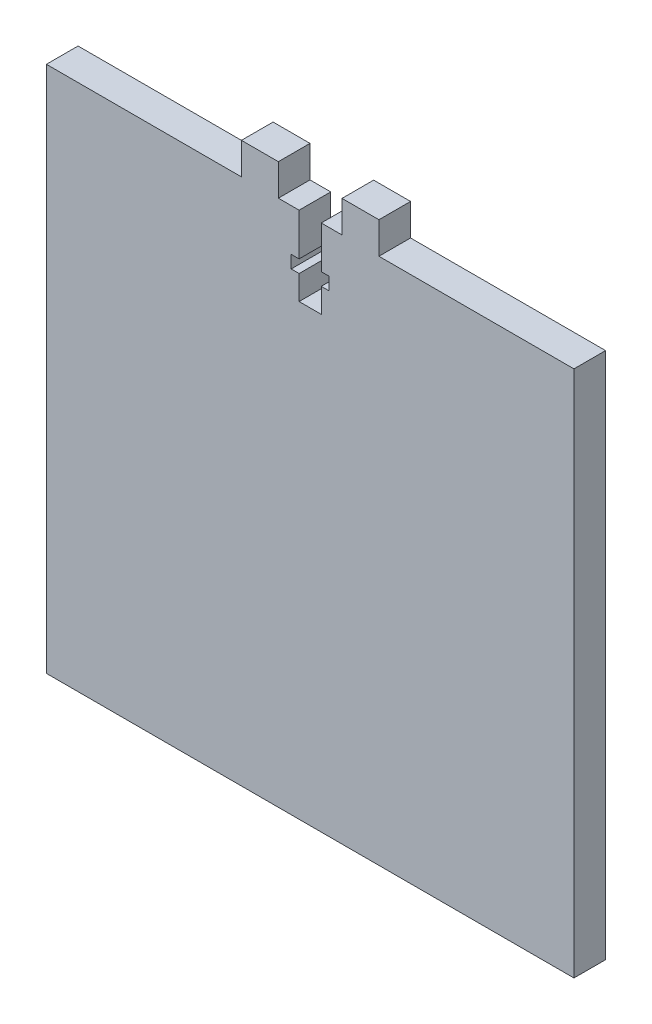
ISO-10303-21;
HEADER;
FILE_DESCRIPTION(('STEP AP214'),'2;1');
FILE_NAME('part.step','',(''),(''),'','','');
FILE_SCHEMA(('AUTOMOTIVE_DESIGN { 1 0 10303 214 1 1 1 1 }'));
ENDSEC;
DATA;
#1=APPLICATION_CONTEXT('core data for automotive mechanical design processes');
#2=APPLICATION_PROTOCOL_DEFINITION('international standard','automotive_design',2000,#1);
#3=PRODUCT_CONTEXT('',#1,'mechanical');
#4=PRODUCT('Part','Part','',(#3));
#5=PRODUCT_RELATED_PRODUCT_CATEGORY('part','',(#4));
#6=PRODUCT_DEFINITION_FORMATION('','',#4);
#7=PRODUCT_DEFINITION_CONTEXT('part definition',#1,'design');
#8=PRODUCT_DEFINITION('design','',#6,#7);
#9=PRODUCT_DEFINITION_SHAPE('','',#8);
#10=(LENGTH_UNIT() NAMED_UNIT(*) SI_UNIT(.MILLI.,.METRE.));
#11=(NAMED_UNIT(*) PLANE_ANGLE_UNIT() SI_UNIT($,.RADIAN.));
#12=(NAMED_UNIT(*) SI_UNIT($,.STERADIAN.) SOLID_ANGLE_UNIT());
#13=UNCERTAINTY_MEASURE_WITH_UNIT(LENGTH_MEASURE(1.E-05),#10,'distance_accuracy_value','');
#14=(GEOMETRIC_REPRESENTATION_CONTEXT(3) GLOBAL_UNCERTAINTY_ASSIGNED_CONTEXT((#13)) GLOBAL_UNIT_ASSIGNED_CONTEXT((#10,
#11,#12)) REPRESENTATION_CONTEXT('',''));
#15=CARTESIAN_POINT('',(0.,0.,0.));
#16=DIRECTION('',(0.,0.,1.));
#17=DIRECTION('',(1.,0.,0.));
#18=AXIS2_PLACEMENT_3D('',#15,#16,#17);
#19=CARTESIAN_POINT('',(-50.,50.,6.));
#20=DIRECTION('',(0.,-1.,0.));
#21=DIRECTION('',(0.,0.,-1.));
#22=AXIS2_PLACEMENT_3D('',#19,#20,#21);
#23=PLANE('',#22);
#24=DIRECTION('',(-1.,0.,0.));
#25=VECTOR('',#24,1.);
#26=CARTESIAN_POINT('',(-50.,50.,6.));
#27=LINE('',#26,#25);
#28=CARTESIAN_POINT('',(-2.10000000000001,50.,6.));
#29=VERTEX_POINT('',#28);
#30=CARTESIAN_POINT('',(-6.03184990821574,50.,6.));
#31=VERTEX_POINT('',#30);
#32=EDGE_CURVE('E358',#29,#31,#27,.T.);
#33=ORIENTED_EDGE('',*,*,#32,.F.);
#34=DIRECTION('',(0.,0.,1.));
#35=VECTOR('',#34,1.);
#36=CARTESIAN_POINT('',(-2.10000000000001,50.,0.));
#37=LINE('',#36,#35);
#38=CARTESIAN_POINT('',(-2.10000000000001,50.,0.));
#39=VERTEX_POINT('',#38);
#40=EDGE_CURVE('E275',#39,#29,#37,.T.);
#41=ORIENTED_EDGE('',*,*,#40,.F.);
#42=DIRECTION('',(-1.,0.,0.));
#43=VECTOR('',#42,1.);
#44=CARTESIAN_POINT('',(-50.,50.,0.));
#45=LINE('',#44,#43);
#46=CARTESIAN_POINT('',(-6.03184990821574,50.,0.));
#47=VERTEX_POINT('',#46);
#48=EDGE_CURVE('E219',#39,#47,#45,.T.);
#49=ORIENTED_EDGE('',*,*,#48,.T.);
#50=DIRECTION('',(0.,0.,1.));
#51=VECTOR('',#50,1.);
#52=CARTESIAN_POINT('',(-6.03184990821574,50.,0.));
#53=LINE('',#52,#51);
#54=EDGE_CURVE('E345',#47,#31,#53,.T.);
#55=ORIENTED_EDGE('',*,*,#54,.T.);
#56=EDGE_LOOP('',(#33,#41,#49,#55));
#57=FACE_BOUND('',#56,.T.);
#58=ADVANCED_FACE('F35',(#57),#23,.F.);
#59=CARTESIAN_POINT('',(50.,50.,0.));
#60=VERTEX_POINT('',#59);
#61=CARTESIAN_POINT('',(13.0318499082157,50.,0.));
#62=VERTEX_POINT('',#61);
#63=EDGE_CURVE('E366',#60,#62,#45,.T.);
#64=ORIENTED_EDGE('',*,*,#63,.T.);
#65=DIRECTION('',(0.,0.,1.));
#66=VECTOR('',#65,1.);
#67=CARTESIAN_POINT('',(13.0318499082157,50.,0.));
#68=LINE('',#67,#66);
#69=CARTESIAN_POINT('',(13.0318499082157,50.,6.));
#70=VERTEX_POINT('',#69);
#71=EDGE_CURVE('E315',#62,#70,#68,.T.);
#72=ORIENTED_EDGE('',*,*,#71,.T.);
#73=CARTESIAN_POINT('',(50.,50.,6.));
#74=VERTEX_POINT('',#73);
#75=EDGE_CURVE('E354',#74,#70,#27,.T.);
#76=ORIENTED_EDGE('',*,*,#75,.F.);
#77=DIRECTION('',(0.,0.,-1.));
#78=VECTOR('',#77,1.);
#79=CARTESIAN_POINT('',(50.,50.,6.));
#80=LINE('',#79,#78);
#81=EDGE_CURVE('E11',#74,#60,#80,.T.);
#82=ORIENTED_EDGE('',*,*,#81,.T.);
#83=EDGE_LOOP('',(#64,#72,#76,#82));
#84=FACE_BOUND('',#83,.T.);
#85=ADVANCED_FACE('F465',(#84),#23,.F.);
#86=DIRECTION('',(0.,0.,1.));
#87=VECTOR('',#86,1.);
#88=CARTESIAN_POINT('',(-13.0318499082157,50.,0.));
#89=LINE('',#88,#87);
#90=CARTESIAN_POINT('',(-13.0318499082157,50.,0.));
#91=VERTEX_POINT('',#90);
#92=CARTESIAN_POINT('',(-13.0318499082157,50.,6.));
#93=VERTEX_POINT('',#92);
#94=EDGE_CURVE('E332',#91,#93,#89,.T.);
#95=ORIENTED_EDGE('',*,*,#94,.F.);
#96=CARTESIAN_POINT('',(-50.,50.,0.));
#97=VERTEX_POINT('',#96);
#98=EDGE_CURVE('E365',#91,#97,#45,.T.);
#99=ORIENTED_EDGE('',*,*,#98,.T.);
#100=DIRECTION('',(0.,0.,-1.));
#101=VECTOR('',#100,1.);
#102=CARTESIAN_POINT('',(-50.,50.,6.));
#103=LINE('',#102,#101);
#104=CARTESIAN_POINT('',(-50.,50.,6.));
#105=VERTEX_POINT('',#104);
#106=EDGE_CURVE('E43',#105,#97,#103,.T.);
#107=ORIENTED_EDGE('',*,*,#106,.F.);
#108=EDGE_CURVE('E352',#93,#105,#27,.T.);
#109=ORIENTED_EDGE('',*,*,#108,.F.);
#110=EDGE_LOOP('',(#95,#99,#107,#109));
#111=FACE_BOUND('',#110,.T.);
#112=ADVANCED_FACE('F410',(#111),#23,.F.);
#113=CARTESIAN_POINT('',(50.,-50.,6.));
#114=DIRECTION('',(-1.,0.,0.));
#115=DIRECTION('',(0.,0.,1.));
#116=AXIS2_PLACEMENT_3D('',#113,#114,#115);
#117=PLANE('',#116);
#118=DIRECTION('',(0.,1.,0.));
#119=VECTOR('',#118,1.);
#120=CARTESIAN_POINT('',(50.,-50.,0.));
#121=LINE('',#120,#119);
#122=CARTESIAN_POINT('',(50.,-50.,0.));
#123=VERTEX_POINT('',#122);
#124=EDGE_CURVE('E342',#123,#60,#121,.T.);
#125=ORIENTED_EDGE('',*,*,#124,.T.);
#126=ORIENTED_EDGE('',*,*,#81,.F.);
#127=DIRECTION('',(0.,1.,0.));
#128=VECTOR('',#127,1.);
#129=CARTESIAN_POINT('',(50.,-50.,6.));
#130=LINE('',#129,#128);
#131=CARTESIAN_POINT('',(50.,-50.,6.));
#132=VERTEX_POINT('',#131);
#133=EDGE_CURVE('E349',#132,#74,#130,.T.);
#134=ORIENTED_EDGE('',*,*,#133,.F.);
#135=DIRECTION('',(0.,0.,-1.));
#136=VECTOR('',#135,1.);
#137=CARTESIAN_POINT('',(50.,-50.,6.));
#138=LINE('',#137,#136);
#139=EDGE_CURVE('E362',#132,#123,#138,.T.);
#140=ORIENTED_EDGE('',*,*,#139,.T.);
#141=EDGE_LOOP('',(#125,#126,#134,#140));
#142=FACE_BOUND('',#141,.T.);
#143=ADVANCED_FACE('F37',(#142),#117,.F.);
#144=CARTESIAN_POINT('',(6.03184990821572,50.,0.));
#145=VERTEX_POINT('',#144);
#146=CARTESIAN_POINT('',(2.09999999999999,50.,0.));
#147=VERTEX_POINT('',#146);
#148=EDGE_CURVE('E369',#145,#147,#45,.T.);
#149=ORIENTED_EDGE('',*,*,#148,.T.);
#150=DIRECTION('',(0.,0.,1.));
#151=VECTOR('',#150,1.);
#152=CARTESIAN_POINT('',(2.09999999999999,50.,0.));
#153=LINE('',#152,#151);
#154=CARTESIAN_POINT('',(2.09999999999999,50.,6.));
#155=VERTEX_POINT('',#154);
#156=EDGE_CURVE('E278',#147,#155,#153,.T.);
#157=ORIENTED_EDGE('',*,*,#156,.T.);
#158=CARTESIAN_POINT('',(6.03184990821572,50.,6.));
#159=VERTEX_POINT('',#158);
#160=EDGE_CURVE('E58',#159,#155,#27,.T.);
#161=ORIENTED_EDGE('',*,*,#160,.F.);
#162=DIRECTION('',(0.,0.,1.));
#163=VECTOR('',#162,1.);
#164=CARTESIAN_POINT('',(6.03184990821572,50.,0.));
#165=LINE('',#164,#163);
#166=EDGE_CURVE('E318',#145,#159,#165,.T.);
#167=ORIENTED_EDGE('',*,*,#166,.F.);
#168=EDGE_LOOP('',(#149,#157,#161,#167));
#169=FACE_BOUND('',#168,.T.);
#170=ADVANCED_FACE('F409',(#169),#23,.F.);
#171=CARTESIAN_POINT('',(-50.,-50.,6.));
#172=DIRECTION('',(1.,0.,0.));
#173=DIRECTION('',(0.,0.,-1.));
#174=AXIS2_PLACEMENT_3D('',#171,#172,#173);
#175=PLANE('',#174);
#176=DIRECTION('',(0.,-1.,0.));
#177=VECTOR('',#176,1.);
#178=CARTESIAN_POINT('',(-50.,-50.,0.));
#179=LINE('',#178,#177);
#180=CARTESIAN_POINT('',(-50.,-50.,0.));
#181=VERTEX_POINT('',#180);
#182=EDGE_CURVE('E368',#97,#181,#179,.T.);
#183=ORIENTED_EDGE('',*,*,#182,.T.);
#184=DIRECTION('',(0.,0.,-1.));
#185=VECTOR('',#184,1.);
#186=CARTESIAN_POINT('',(-50.,-50.,6.));
#187=LINE('',#186,#185);
#188=CARTESIAN_POINT('',(-50.,-50.,6.));
#189=VERTEX_POINT('',#188);
#190=EDGE_CURVE('E374',#189,#181,#187,.T.);
#191=ORIENTED_EDGE('',*,*,#190,.F.);
#192=DIRECTION('',(0.,-1.,0.));
#193=VECTOR('',#192,1.);
#194=CARTESIAN_POINT('',(-50.,-50.,6.));
#195=LINE('',#194,#193);
#196=EDGE_CURVE('E357',#105,#189,#195,.T.);
#197=ORIENTED_EDGE('',*,*,#196,.F.);
#198=ORIENTED_EDGE('',*,*,#106,.T.);
#199=EDGE_LOOP('',(#183,#191,#197,#198));
#200=FACE_BOUND('',#199,.T.);
#201=ADVANCED_FACE('F381',(#200),#175,.F.);
#202=CARTESIAN_POINT('',(-50.,-50.,6.));
#203=DIRECTION('',(0.,1.,0.));
#204=DIRECTION('',(0.,0.,1.));
#205=AXIS2_PLACEMENT_3D('',#202,#203,#204);
#206=PLANE('',#205);
#207=DIRECTION('',(1.,0.,0.));
#208=VECTOR('',#207,1.);
#209=CARTESIAN_POINT('',(-50.,-50.,0.));
#210=LINE('',#209,#208);
#211=EDGE_CURVE('E353',#181,#123,#210,.T.);
#212=ORIENTED_EDGE('',*,*,#211,.T.);
#213=ORIENTED_EDGE('',*,*,#139,.F.);
#214=DIRECTION('',(1.,0.,0.));
#215=VECTOR('',#214,1.);
#216=CARTESIAN_POINT('',(-50.,-50.,6.));
#217=LINE('',#216,#215);
#218=EDGE_CURVE('E360',#189,#132,#217,.T.);
#219=ORIENTED_EDGE('',*,*,#218,.F.);
#220=ORIENTED_EDGE('',*,*,#190,.T.);
#221=EDGE_LOOP('',(#212,#213,#219,#220));
#222=FACE_BOUND('',#221,.T.);
#223=ADVANCED_FACE('F391',(#222),#206,.F.);
#224=CARTESIAN_POINT('',(0.,0.,6.));
#225=DIRECTION('',(0.,0.,-1.));
#226=DIRECTION('',(-1.,0.,0.));
#227=AXIS2_PLACEMENT_3D('',#224,#225,#226);
#228=PLANE('',#227);
#229=DIRECTION('',(-1.,0.,0.));
#230=VECTOR('',#229,1.);
#231=CARTESIAN_POINT('',(-2.10000000000001,42.,6.));
#232=LINE('',#231,#230);
#233=CARTESIAN_POINT('',(-2.10000000000001,42.,6.));
#234=VERTEX_POINT('',#233);
#235=CARTESIAN_POINT('',(-3.60000000000001,42.,6.));
#236=VERTEX_POINT('',#235);
#237=EDGE_CURVE('E250',#234,#236,#232,.T.);
#238=ORIENTED_EDGE('',*,*,#237,.F.);
#239=DIRECTION('',(0.,-1.,0.));
#240=VECTOR('',#239,1.);
#241=CARTESIAN_POINT('',(-2.10000000000001,42.,6.));
#242=LINE('',#241,#240);
#243=EDGE_CURVE('E204',#29,#234,#242,.T.);
#244=ORIENTED_EDGE('',*,*,#243,.F.);
#245=ORIENTED_EDGE('',*,*,#32,.T.);
#246=DIRECTION('',(0.,1.,0.));
#247=VECTOR('',#246,1.);
#248=CARTESIAN_POINT('',(-6.03184990821574,50.,6.));
#249=LINE('',#248,#247);
#250=CARTESIAN_POINT('',(-6.03184990821574,56.,6.));
#251=VERTEX_POINT('',#250);
#252=EDGE_CURVE('E335',#31,#251,#249,.T.);
#253=ORIENTED_EDGE('',*,*,#252,.T.);
#254=DIRECTION('',(-1.,0.,0.));
#255=VECTOR('',#254,1.);
#256=CARTESIAN_POINT('',(-13.0318499082157,56.,6.));
#257=LINE('',#256,#255);
#258=CARTESIAN_POINT('',(-13.0318499082157,56.,6.));
#259=VERTEX_POINT('',#258);
#260=EDGE_CURVE('E326',#251,#259,#257,.T.);
#261=ORIENTED_EDGE('',*,*,#260,.T.);
#262=DIRECTION('',(0.,-1.,0.));
#263=VECTOR('',#262,1.);
#264=CARTESIAN_POINT('',(-13.0318499082157,50.,6.));
#265=LINE('',#264,#263);
#266=EDGE_CURVE('E317',#259,#93,#265,.T.);
#267=ORIENTED_EDGE('',*,*,#266,.T.);
#268=ORIENTED_EDGE('',*,*,#108,.T.);
#269=ORIENTED_EDGE('',*,*,#196,.T.);
#270=ORIENTED_EDGE('',*,*,#218,.T.);
#271=ORIENTED_EDGE('',*,*,#133,.T.);
#272=ORIENTED_EDGE('',*,*,#75,.T.);
#273=DIRECTION('',(0.,1.,0.));
#274=VECTOR('',#273,1.);
#275=CARTESIAN_POINT('',(13.0318499082157,50.,6.));
#276=LINE('',#275,#274);
#277=CARTESIAN_POINT('',(13.0318499082157,56.,6.));
#278=VERTEX_POINT('',#277);
#279=EDGE_CURVE('E277',#70,#278,#276,.T.);
#280=ORIENTED_EDGE('',*,*,#279,.T.);
#281=DIRECTION('',(-1.,0.,0.));
#282=VECTOR('',#281,1.);
#283=CARTESIAN_POINT('',(13.0318499082157,56.,6.));
#284=LINE('',#283,#282);
#285=CARTESIAN_POINT('',(6.03184990821572,56.,6.));
#286=VERTEX_POINT('',#285);
#287=EDGE_CURVE('E310',#278,#286,#284,.T.);
#288=ORIENTED_EDGE('',*,*,#287,.T.);
#289=DIRECTION('',(0.,-1.,0.));
#290=VECTOR('',#289,1.);
#291=CARTESIAN_POINT('',(6.03184990821572,50.,6.));
#292=LINE('',#291,#290);
#293=EDGE_CURVE('E301',#286,#159,#292,.T.);
#294=ORIENTED_EDGE('',*,*,#293,.T.);
#295=ORIENTED_EDGE('',*,*,#160,.T.);
#296=DIRECTION('',(0.,1.,0.));
#297=VECTOR('',#296,1.);
#298=CARTESIAN_POINT('',(2.09999999999999,50.,6.));
#299=LINE('',#298,#297);
#300=CARTESIAN_POINT('',(2.09999999999999,42.,6.));
#301=VERTEX_POINT('',#300);
#302=EDGE_CURVE('E220',#301,#155,#299,.T.);
#303=ORIENTED_EDGE('',*,*,#302,.F.);
#304=DIRECTION('',(-1.,0.,0.));
#305=VECTOR('',#304,1.);
#306=CARTESIAN_POINT('',(2.09999999999999,42.,6.));
#307=LINE('',#306,#305);
#308=CARTESIAN_POINT('',(3.59999999999999,42.,6.));
#309=VERTEX_POINT('',#308);
#310=EDGE_CURVE('E222',#309,#301,#307,.T.);
#311=ORIENTED_EDGE('',*,*,#310,.F.);
#312=DIRECTION('',(0.,1.,0.));
#313=VECTOR('',#312,1.);
#314=CARTESIAN_POINT('',(3.59999999999999,42.,6.));
#315=LINE('',#314,#313);
#316=CARTESIAN_POINT('',(3.59999999999999,39.6,6.));
#317=VERTEX_POINT('',#316);
#318=EDGE_CURVE('E270',#317,#309,#315,.T.);
#319=ORIENTED_EDGE('',*,*,#318,.F.);
#320=DIRECTION('',(1.,0.,0.));
#321=VECTOR('',#320,1.);
#322=CARTESIAN_POINT('',(3.59999999999999,39.6,6.));
#323=LINE('',#322,#321);
#324=CARTESIAN_POINT('',(2.09999999999999,39.6,6.));
#325=VERTEX_POINT('',#324);
#326=EDGE_CURVE('E267',#325,#317,#323,.T.);
#327=ORIENTED_EDGE('',*,*,#326,.F.);
#328=DIRECTION('',(0.,1.,0.));
#329=VECTOR('',#328,1.);
#330=CARTESIAN_POINT('',(2.09999999999999,39.6,6.));
#331=LINE('',#330,#329);
#332=CARTESIAN_POINT('',(2.09999999999999,35.,6.));
#333=VERTEX_POINT('',#332);
#334=EDGE_CURVE('E264',#333,#325,#331,.T.);
#335=ORIENTED_EDGE('',*,*,#334,.F.);
#336=DIRECTION('',(1.,0.,0.));
#337=VECTOR('',#336,1.);
#338=CARTESIAN_POINT('',(2.09999999999999,35.,6.));
#339=LINE('',#338,#337);
#340=CARTESIAN_POINT('',(-2.10000000000001,35.,6.));
#341=VERTEX_POINT('',#340);
#342=EDGE_CURVE('E261',#341,#333,#339,.T.);
#343=ORIENTED_EDGE('',*,*,#342,.F.);
#344=DIRECTION('',(0.,-1.,0.));
#345=VECTOR('',#344,1.);
#346=CARTESIAN_POINT('',(-2.10000000000001,35.,6.));
#347=LINE('',#346,#345);
#348=CARTESIAN_POINT('',(-2.10000000000001,39.6,6.));
#349=VERTEX_POINT('',#348);
#350=EDGE_CURVE('E258',#349,#341,#347,.T.);
#351=ORIENTED_EDGE('',*,*,#350,.F.);
#352=DIRECTION('',(1.,0.,0.));
#353=VECTOR('',#352,1.);
#354=CARTESIAN_POINT('',(-3.60000000000001,39.6,6.));
#355=LINE('',#354,#353);
#356=CARTESIAN_POINT('',(-3.60000000000001,39.6,6.));
#357=VERTEX_POINT('',#356);
#358=EDGE_CURVE('E255',#357,#349,#355,.T.);
#359=ORIENTED_EDGE('',*,*,#358,.F.);
#360=DIRECTION('',(0.,-1.,0.));
#361=VECTOR('',#360,1.);
#362=CARTESIAN_POINT('',(-3.60000000000001,42.,6.));
#363=LINE('',#362,#361);
#364=EDGE_CURVE('E252',#236,#357,#363,.T.);
#365=ORIENTED_EDGE('',*,*,#364,.F.);
#366=EDGE_LOOP('',(#238,#244,#245,#253,#261,#267,#268,#269,#270,#271,#272,#280,#288,#294,#295,
#303,#311,#319,#327,#335,#343,#351,#359,#365));
#367=FACE_BOUND('',#366,.T.);
#368=ADVANCED_FACE('F397',(#367),#228,.F.);
#369=CARTESIAN_POINT('',(0.,0.,0.));
#370=DIRECTION('',(0.,0.,-1.));
#371=DIRECTION('',(-1.,0.,0.));
#372=AXIS2_PLACEMENT_3D('',#369,#370,#371);
#373=PLANE('',#372);
#374=DIRECTION('',(0.,-1.,0.));
#375=VECTOR('',#374,1.);
#376=CARTESIAN_POINT('',(-2.10000000000001,42.,0.));
#377=LINE('',#376,#375);
#378=CARTESIAN_POINT('',(-2.10000000000001,42.,0.));
#379=VERTEX_POINT('',#378);
#380=EDGE_CURVE('E201',#39,#379,#377,.T.);
#381=ORIENTED_EDGE('',*,*,#380,.T.);
#382=DIRECTION('',(-1.,0.,0.));
#383=VECTOR('',#382,1.);
#384=CARTESIAN_POINT('',(-2.10000000000001,42.,0.));
#385=LINE('',#384,#383);
#386=CARTESIAN_POINT('',(-3.60000000000001,42.,0.));
#387=VERTEX_POINT('',#386);
#388=EDGE_CURVE('E212',#379,#387,#385,.T.);
#389=ORIENTED_EDGE('',*,*,#388,.T.);
#390=DIRECTION('',(0.,-1.,0.));
#391=VECTOR('',#390,1.);
#392=CARTESIAN_POINT('',(-3.60000000000001,42.,0.));
#393=LINE('',#392,#391);
#394=CARTESIAN_POINT('',(-3.60000000000001,39.6,0.));
#395=VERTEX_POINT('',#394);
#396=EDGE_CURVE('E50',#387,#395,#393,.T.);
#397=ORIENTED_EDGE('',*,*,#396,.T.);
#398=DIRECTION('',(1.,0.,0.));
#399=VECTOR('',#398,1.);
#400=CARTESIAN_POINT('',(-3.60000000000001,39.6,0.));
#401=LINE('',#400,#399);
#402=CARTESIAN_POINT('',(-2.10000000000001,39.6,0.));
#403=VERTEX_POINT('',#402);
#404=EDGE_CURVE('E226',#395,#403,#401,.T.);
#405=ORIENTED_EDGE('',*,*,#404,.T.);
#406=DIRECTION('',(0.,-1.,0.));
#407=VECTOR('',#406,1.);
#408=CARTESIAN_POINT('',(-2.10000000000001,35.,0.));
#409=LINE('',#408,#407);
#410=CARTESIAN_POINT('',(-2.10000000000001,35.,0.));
#411=VERTEX_POINT('',#410);
#412=EDGE_CURVE('E229',#403,#411,#409,.T.);
#413=ORIENTED_EDGE('',*,*,#412,.T.);
#414=DIRECTION('',(1.,0.,0.));
#415=VECTOR('',#414,1.);
#416=CARTESIAN_POINT('',(2.09999999999999,35.,0.));
#417=LINE('',#416,#415);
#418=CARTESIAN_POINT('',(2.09999999999999,35.,0.));
#419=VERTEX_POINT('',#418);
#420=EDGE_CURVE('E232',#411,#419,#417,.T.);
#421=ORIENTED_EDGE('',*,*,#420,.T.);
#422=DIRECTION('',(0.,1.,0.));
#423=VECTOR('',#422,1.);
#424=CARTESIAN_POINT('',(2.09999999999999,39.6,0.));
#425=LINE('',#424,#423);
#426=CARTESIAN_POINT('',(2.09999999999999,39.6,0.));
#427=VERTEX_POINT('',#426);
#428=EDGE_CURVE('E235',#419,#427,#425,.T.);
#429=ORIENTED_EDGE('',*,*,#428,.T.);
#430=DIRECTION('',(1.,0.,0.));
#431=VECTOR('',#430,1.);
#432=CARTESIAN_POINT('',(3.59999999999999,39.6,0.));
#433=LINE('',#432,#431);
#434=CARTESIAN_POINT('',(3.59999999999999,39.6,0.));
#435=VERTEX_POINT('',#434);
#436=EDGE_CURVE('E238',#427,#435,#433,.T.);
#437=ORIENTED_EDGE('',*,*,#436,.T.);
#438=DIRECTION('',(0.,1.,0.));
#439=VECTOR('',#438,1.);
#440=CARTESIAN_POINT('',(3.59999999999999,42.,0.));
#441=LINE('',#440,#439);
#442=CARTESIAN_POINT('',(3.59999999999999,42.,0.));
#443=VERTEX_POINT('',#442);
#444=EDGE_CURVE('E241',#435,#443,#441,.T.);
#445=ORIENTED_EDGE('',*,*,#444,.T.);
#446=DIRECTION('',(-1.,0.,0.));
#447=VECTOR('',#446,1.);
#448=CARTESIAN_POINT('',(2.09999999999999,42.,0.));
#449=LINE('',#448,#447);
#450=CARTESIAN_POINT('',(2.09999999999999,42.,0.));
#451=VERTEX_POINT('',#450);
#452=EDGE_CURVE('E244',#443,#451,#449,.T.);
#453=ORIENTED_EDGE('',*,*,#452,.T.);
#454=DIRECTION('',(0.,1.,0.));
#455=VECTOR('',#454,1.);
#456=CARTESIAN_POINT('',(2.09999999999999,50.,0.));
#457=LINE('',#456,#455);
#458=EDGE_CURVE('E209',#451,#147,#457,.T.);
#459=ORIENTED_EDGE('',*,*,#458,.T.);
#460=ORIENTED_EDGE('',*,*,#148,.F.);
#461=DIRECTION('',(0.,-1.,0.));
#462=VECTOR('',#461,1.);
#463=CARTESIAN_POINT('',(6.03184990821572,50.,0.));
#464=LINE('',#463,#462);
#465=CARTESIAN_POINT('',(6.03184990821572,56.,0.));
#466=VERTEX_POINT('',#465);
#467=EDGE_CURVE('E304',#466,#145,#464,.T.);
#468=ORIENTED_EDGE('',*,*,#467,.F.);
#469=DIRECTION('',(-1.,0.,0.));
#470=VECTOR('',#469,1.);
#471=CARTESIAN_POINT('',(13.0318499082157,56.,0.));
#472=LINE('',#471,#470);
#473=CARTESIAN_POINT('',(13.0318499082157,56.,0.));
#474=VERTEX_POINT('',#473);
#475=EDGE_CURVE('E300',#474,#466,#472,.T.);
#476=ORIENTED_EDGE('',*,*,#475,.F.);
#477=DIRECTION('',(0.,1.,0.));
#478=VECTOR('',#477,1.);
#479=CARTESIAN_POINT('',(13.0318499082157,50.,0.));
#480=LINE('',#479,#478);
#481=EDGE_CURVE('E297',#62,#474,#480,.T.);
#482=ORIENTED_EDGE('',*,*,#481,.F.);
#483=ORIENTED_EDGE('',*,*,#63,.F.);
#484=ORIENTED_EDGE('',*,*,#124,.F.);
#485=ORIENTED_EDGE('',*,*,#211,.F.);
#486=ORIENTED_EDGE('',*,*,#182,.F.);
#487=ORIENTED_EDGE('',*,*,#98,.F.);
#488=DIRECTION('',(0.,-1.,0.));
#489=VECTOR('',#488,1.);
#490=CARTESIAN_POINT('',(-13.0318499082157,50.,0.));
#491=LINE('',#490,#489);
#492=CARTESIAN_POINT('',(-13.0318499082157,56.,0.));
#493=VERTEX_POINT('',#492);
#494=EDGE_CURVE('E323',#493,#91,#491,.T.);
#495=ORIENTED_EDGE('',*,*,#494,.F.);
#496=DIRECTION('',(-1.,0.,0.));
#497=VECTOR('',#496,1.);
#498=CARTESIAN_POINT('',(-13.0318499082157,56.,0.));
#499=LINE('',#498,#497);
#500=CARTESIAN_POINT('',(-6.03184990821574,56.,0.));
#501=VERTEX_POINT('',#500);
#502=EDGE_CURVE('E329',#501,#493,#499,.T.);
#503=ORIENTED_EDGE('',*,*,#502,.F.);
#504=DIRECTION('',(0.,1.,0.));
#505=VECTOR('',#504,1.);
#506=CARTESIAN_POINT('',(-6.03184990821574,50.,0.));
#507=LINE('',#506,#505);
#508=EDGE_CURVE('E325',#47,#501,#507,.T.);
#509=ORIENTED_EDGE('',*,*,#508,.F.);
#510=ORIENTED_EDGE('',*,*,#48,.F.);
#511=EDGE_LOOP('',(#381,#389,#397,#405,#413,#421,#429,#437,#445,#453,#459,#460,#468,#476,#482,
#483,#484,#485,#486,#487,#495,#503,#509,#510));
#512=FACE_BOUND('',#511,.T.);
#513=ADVANCED_FACE('F217',(#512),#373,.T.);
#514=CARTESIAN_POINT('',(-13.0318499082157,50.,0.));
#515=DIRECTION('',(-1.,0.,0.));
#516=DIRECTION('',(0.,0.,1.));
#517=AXIS2_PLACEMENT_3D('',#514,#515,#516);
#518=PLANE('',#517);
#519=ORIENTED_EDGE('',*,*,#266,.F.);
#520=DIRECTION('',(0.,0.,1.));
#521=VECTOR('',#520,1.);
#522=CARTESIAN_POINT('',(-13.0318499082157,56.,0.));
#523=LINE('',#522,#521);
#524=EDGE_CURVE('E340',#493,#259,#523,.T.);
#525=ORIENTED_EDGE('',*,*,#524,.F.);
#526=ORIENTED_EDGE('',*,*,#494,.T.);
#527=ORIENTED_EDGE('',*,*,#94,.T.);
#528=EDGE_LOOP('',(#519,#525,#526,#527));
#529=FACE_BOUND('',#528,.T.);
#530=ADVANCED_FACE('F412',(#529),#518,.T.);
#531=CARTESIAN_POINT('',(-13.0318499082157,56.,0.));
#532=DIRECTION('',(0.,1.,0.));
#533=DIRECTION('',(0.,0.,1.));
#534=AXIS2_PLACEMENT_3D('',#531,#532,#533);
#535=PLANE('',#534);
#536=ORIENTED_EDGE('',*,*,#260,.F.);
#537=DIRECTION('',(0.,0.,1.));
#538=VECTOR('',#537,1.);
#539=CARTESIAN_POINT('',(-6.03184990821574,56.,0.));
#540=LINE('',#539,#538);
#541=EDGE_CURVE('E343',#501,#251,#540,.T.);
#542=ORIENTED_EDGE('',*,*,#541,.F.);
#543=ORIENTED_EDGE('',*,*,#502,.T.);
#544=ORIENTED_EDGE('',*,*,#524,.T.);
#545=EDGE_LOOP('',(#536,#542,#543,#544));
#546=FACE_BOUND('',#545,.T.);
#547=ADVANCED_FACE('F416',(#546),#535,.T.);
#548=CARTESIAN_POINT('',(-6.03184990821574,50.,0.));
#549=DIRECTION('',(1.,0.,0.));
#550=DIRECTION('',(0.,1.,0.));
#551=AXIS2_PLACEMENT_3D('',#548,#549,#550);
#552=PLANE('',#551);
#553=ORIENTED_EDGE('',*,*,#252,.F.);
#554=ORIENTED_EDGE('',*,*,#54,.F.);
#555=ORIENTED_EDGE('',*,*,#508,.T.);
#556=ORIENTED_EDGE('',*,*,#541,.T.);
#557=EDGE_LOOP('',(#553,#554,#555,#556));
#558=FACE_BOUND('',#557,.T.);
#559=ADVANCED_FACE('F420',(#558),#552,.T.);
#560=CARTESIAN_POINT('',(13.0318499082157,50.,0.));
#561=DIRECTION('',(1.,0.,0.));
#562=DIRECTION('',(0.,0.,-1.));
#563=AXIS2_PLACEMENT_3D('',#560,#561,#562);
#564=PLANE('',#563);
#565=ORIENTED_EDGE('',*,*,#279,.F.);
#566=ORIENTED_EDGE('',*,*,#71,.F.);
#567=ORIENTED_EDGE('',*,*,#481,.T.);
#568=DIRECTION('',(0.,0.,1.));
#569=VECTOR('',#568,1.);
#570=CARTESIAN_POINT('',(13.0318499082157,56.,0.));
#571=LINE('',#570,#569);
#572=EDGE_CURVE('E307',#474,#278,#571,.T.);
#573=ORIENTED_EDGE('',*,*,#572,.T.);
#574=EDGE_LOOP('',(#565,#566,#567,#573));
#575=FACE_BOUND('',#574,.T.);
#576=ADVANCED_FACE('F557',(#575),#564,.T.);
#577=CARTESIAN_POINT('',(6.03184990821572,50.,0.));
#578=DIRECTION('',(-1.,0.,0.));
#579=DIRECTION('',(0.,0.,1.));
#580=AXIS2_PLACEMENT_3D('',#577,#578,#579);
#581=PLANE('',#580);
#582=ORIENTED_EDGE('',*,*,#293,.F.);
#583=DIRECTION('',(0.,0.,1.));
#584=VECTOR('',#583,1.);
#585=CARTESIAN_POINT('',(6.03184990821572,56.,0.));
#586=LINE('',#585,#584);
#587=EDGE_CURVE('E320',#466,#286,#586,.T.);
#588=ORIENTED_EDGE('',*,*,#587,.F.);
#589=ORIENTED_EDGE('',*,*,#467,.T.);
#590=ORIENTED_EDGE('',*,*,#166,.T.);
#591=EDGE_LOOP('',(#582,#588,#589,#590));
#592=FACE_BOUND('',#591,.T.);
#593=ADVANCED_FACE('F406',(#592),#581,.T.);
#594=CARTESIAN_POINT('',(13.0318499082157,56.,0.));
#595=DIRECTION('',(0.,1.,0.));
#596=DIRECTION('',(0.,0.,1.));
#597=AXIS2_PLACEMENT_3D('',#594,#595,#596);
#598=PLANE('',#597);
#599=ORIENTED_EDGE('',*,*,#287,.F.);
#600=ORIENTED_EDGE('',*,*,#572,.F.);
#601=ORIENTED_EDGE('',*,*,#475,.T.);
#602=ORIENTED_EDGE('',*,*,#587,.T.);
#603=EDGE_LOOP('',(#599,#600,#601,#602));
#604=FACE_BOUND('',#603,.T.);
#605=ADVANCED_FACE('F462',(#604),#598,.T.);
#606=CARTESIAN_POINT('',(-2.10000000000001,42.,0.));
#607=DIRECTION('',(-1.,0.,0.));
#608=DIRECTION('',(0.,0.,1.));
#609=AXIS2_PLACEMENT_3D('',#606,#607,#608);
#610=PLANE('',#609);
#611=ORIENTED_EDGE('',*,*,#243,.T.);
#612=DIRECTION('',(0.,0.,1.));
#613=VECTOR('',#612,1.);
#614=CARTESIAN_POINT('',(-2.10000000000001,42.,0.));
#615=LINE('',#614,#613);
#616=EDGE_CURVE('E197',#379,#234,#615,.T.);
#617=ORIENTED_EDGE('',*,*,#616,.F.);
#618=ORIENTED_EDGE('',*,*,#380,.F.);
#619=ORIENTED_EDGE('',*,*,#40,.T.);
#620=EDGE_LOOP('',(#611,#617,#618,#619));
#621=FACE_BOUND('',#620,.T.);
#622=ADVANCED_FACE('F199',(#621),#610,.F.);
#623=CARTESIAN_POINT('',(2.09999999999999,50.,0.));
#624=DIRECTION('',(1.,0.,0.));
#625=DIRECTION('',(0.,0.,-1.));
#626=AXIS2_PLACEMENT_3D('',#623,#624,#625);
#627=PLANE('',#626);
#628=ORIENTED_EDGE('',*,*,#302,.T.);
#629=ORIENTED_EDGE('',*,*,#156,.F.);
#630=ORIENTED_EDGE('',*,*,#458,.F.);
#631=DIRECTION('',(0.,0.,1.));
#632=VECTOR('',#631,1.);
#633=CARTESIAN_POINT('',(2.09999999999999,42.,0.));
#634=LINE('',#633,#632);
#635=EDGE_CURVE('E280',#451,#301,#634,.T.);
#636=ORIENTED_EDGE('',*,*,#635,.T.);
#637=EDGE_LOOP('',(#628,#629,#630,#636));
#638=FACE_BOUND('',#637,.T.);
#639=ADVANCED_FACE('F454',(#638),#627,.F.);
#640=CARTESIAN_POINT('',(2.09999999999999,42.,0.));
#641=DIRECTION('',(0.,1.,0.));
#642=DIRECTION('',(0.,0.,1.));
#643=AXIS2_PLACEMENT_3D('',#640,#641,#642);
#644=PLANE('',#643);
#645=ORIENTED_EDGE('',*,*,#310,.T.);
#646=ORIENTED_EDGE('',*,*,#635,.F.);
#647=ORIENTED_EDGE('',*,*,#452,.F.);
#648=DIRECTION('',(0.,0.,1.));
#649=VECTOR('',#648,1.);
#650=CARTESIAN_POINT('',(3.59999999999999,42.,0.));
#651=LINE('',#650,#649);
#652=EDGE_CURVE('E282',#443,#309,#651,.T.);
#653=ORIENTED_EDGE('',*,*,#652,.T.);
#654=EDGE_LOOP('',(#645,#646,#647,#653));
#655=FACE_BOUND('',#654,.T.);
#656=ADVANCED_FACE('F451',(#655),#644,.F.);
#657=CARTESIAN_POINT('',(3.59999999999999,42.,0.));
#658=DIRECTION('',(1.,0.,0.));
#659=DIRECTION('',(0.,0.,-1.));
#660=AXIS2_PLACEMENT_3D('',#657,#658,#659);
#661=PLANE('',#660);
#662=ORIENTED_EDGE('',*,*,#318,.T.);
#663=ORIENTED_EDGE('',*,*,#652,.F.);
#664=ORIENTED_EDGE('',*,*,#444,.F.);
#665=DIRECTION('',(0.,0.,1.));
#666=VECTOR('',#665,1.);
#667=CARTESIAN_POINT('',(3.59999999999999,39.6,0.));
#668=LINE('',#667,#666);
#669=EDGE_CURVE('E284',#435,#317,#668,.T.);
#670=ORIENTED_EDGE('',*,*,#669,.T.);
#671=EDGE_LOOP('',(#662,#663,#664,#670));
#672=FACE_BOUND('',#671,.T.);
#673=ADVANCED_FACE('F448',(#672),#661,.F.);
#674=CARTESIAN_POINT('',(3.59999999999999,39.6,0.));
#675=DIRECTION('',(0.,-1.,0.));
#676=DIRECTION('',(0.,0.,-1.));
#677=AXIS2_PLACEMENT_3D('',#674,#675,#676);
#678=PLANE('',#677);
#679=ORIENTED_EDGE('',*,*,#326,.T.);
#680=ORIENTED_EDGE('',*,*,#669,.F.);
#681=ORIENTED_EDGE('',*,*,#436,.F.);
#682=DIRECTION('',(0.,0.,1.));
#683=VECTOR('',#682,1.);
#684=CARTESIAN_POINT('',(2.09999999999999,39.6,0.));
#685=LINE('',#684,#683);
#686=EDGE_CURVE('E286',#427,#325,#685,.T.);
#687=ORIENTED_EDGE('',*,*,#686,.T.);
#688=EDGE_LOOP('',(#679,#680,#681,#687));
#689=FACE_BOUND('',#688,.T.);
#690=ADVANCED_FACE('F444',(#689),#678,.F.);
#691=CARTESIAN_POINT('',(2.09999999999999,39.6,0.));
#692=DIRECTION('',(1.,0.,0.));
#693=DIRECTION('',(0.,0.,-1.));
#694=AXIS2_PLACEMENT_3D('',#691,#692,#693);
#695=PLANE('',#694);
#696=ORIENTED_EDGE('',*,*,#334,.T.);
#697=ORIENTED_EDGE('',*,*,#686,.F.);
#698=ORIENTED_EDGE('',*,*,#428,.F.);
#699=DIRECTION('',(0.,0.,1.));
#700=VECTOR('',#699,1.);
#701=CARTESIAN_POINT('',(2.09999999999999,35.,0.));
#702=LINE('',#701,#700);
#703=EDGE_CURVE('E288',#419,#333,#702,.T.);
#704=ORIENTED_EDGE('',*,*,#703,.T.);
#705=EDGE_LOOP('',(#696,#697,#698,#704));
#706=FACE_BOUND('',#705,.T.);
#707=ADVANCED_FACE('F440',(#706),#695,.F.);
#708=CARTESIAN_POINT('',(2.09999999999999,35.,0.));
#709=DIRECTION('',(0.,-1.,0.));
#710=DIRECTION('',(0.,0.,-1.));
#711=AXIS2_PLACEMENT_3D('',#708,#709,#710);
#712=PLANE('',#711);
#713=ORIENTED_EDGE('',*,*,#342,.T.);
#714=ORIENTED_EDGE('',*,*,#703,.F.);
#715=ORIENTED_EDGE('',*,*,#420,.F.);
#716=DIRECTION('',(0.,0.,1.));
#717=VECTOR('',#716,1.);
#718=CARTESIAN_POINT('',(-2.10000000000001,35.,0.));
#719=LINE('',#718,#717);
#720=EDGE_CURVE('E290',#411,#341,#719,.T.);
#721=ORIENTED_EDGE('',*,*,#720,.T.);
#722=EDGE_LOOP('',(#713,#714,#715,#721));
#723=FACE_BOUND('',#722,.T.);
#724=ADVANCED_FACE('F436',(#723),#712,.F.);
#725=CARTESIAN_POINT('',(-2.10000000000001,35.,0.));
#726=DIRECTION('',(-1.,0.,0.));
#727=DIRECTION('',(0.,0.,1.));
#728=AXIS2_PLACEMENT_3D('',#725,#726,#727);
#729=PLANE('',#728);
#730=ORIENTED_EDGE('',*,*,#350,.T.);
#731=ORIENTED_EDGE('',*,*,#720,.F.);
#732=ORIENTED_EDGE('',*,*,#412,.F.);
#733=DIRECTION('',(0.,0.,1.));
#734=VECTOR('',#733,1.);
#735=CARTESIAN_POINT('',(-2.10000000000001,39.6,0.));
#736=LINE('',#735,#734);
#737=EDGE_CURVE('E292',#403,#349,#736,.T.);
#738=ORIENTED_EDGE('',*,*,#737,.T.);
#739=EDGE_LOOP('',(#730,#731,#732,#738));
#740=FACE_BOUND('',#739,.T.);
#741=ADVANCED_FACE('F433',(#740),#729,.F.);
#742=CARTESIAN_POINT('',(-3.60000000000001,39.6,0.));
#743=DIRECTION('',(0.,-1.,0.));
#744=DIRECTION('',(0.,0.,-1.));
#745=AXIS2_PLACEMENT_3D('',#742,#743,#744);
#746=PLANE('',#745);
#747=ORIENTED_EDGE('',*,*,#358,.T.);
#748=ORIENTED_EDGE('',*,*,#737,.F.);
#749=ORIENTED_EDGE('',*,*,#404,.F.);
#750=DIRECTION('',(0.,0.,1.));
#751=VECTOR('',#750,1.);
#752=CARTESIAN_POINT('',(-3.60000000000001,39.6,0.));
#753=LINE('',#752,#751);
#754=EDGE_CURVE('E294',#395,#357,#753,.T.);
#755=ORIENTED_EDGE('',*,*,#754,.T.);
#756=EDGE_LOOP('',(#747,#748,#749,#755));
#757=FACE_BOUND('',#756,.T.);
#758=ADVANCED_FACE('F429',(#757),#746,.F.);
#759=CARTESIAN_POINT('',(-3.60000000000001,42.,0.));
#760=DIRECTION('',(-1.,0.,0.));
#761=DIRECTION('',(0.,0.,1.));
#762=AXIS2_PLACEMENT_3D('',#759,#760,#761);
#763=PLANE('',#762);
#764=ORIENTED_EDGE('',*,*,#364,.T.);
#765=ORIENTED_EDGE('',*,*,#754,.F.);
#766=ORIENTED_EDGE('',*,*,#396,.F.);
#767=DIRECTION('',(0.,0.,1.));
#768=VECTOR('',#767,1.);
#769=CARTESIAN_POINT('',(-3.60000000000001,42.,0.));
#770=LINE('',#769,#768);
#771=EDGE_CURVE('E208',#387,#236,#770,.T.);
#772=ORIENTED_EDGE('',*,*,#771,.T.);
#773=EDGE_LOOP('',(#764,#765,#766,#772));
#774=FACE_BOUND('',#773,.T.);
#775=ADVANCED_FACE('F426',(#774),#763,.F.);
#776=CARTESIAN_POINT('',(-2.10000000000001,42.,0.));
#777=DIRECTION('',(0.,1.,0.));
#778=DIRECTION('',(0.,0.,1.));
#779=AXIS2_PLACEMENT_3D('',#776,#777,#778);
#780=PLANE('',#779);
#781=ORIENTED_EDGE('',*,*,#237,.T.);
#782=ORIENTED_EDGE('',*,*,#771,.F.);
#783=ORIENTED_EDGE('',*,*,#388,.F.);
#784=ORIENTED_EDGE('',*,*,#616,.T.);
#785=EDGE_LOOP('',(#781,#782,#783,#784));
#786=FACE_BOUND('',#785,.T.);
#787=ADVANCED_FACE('F213',(#786),#780,.F.);
#788=CLOSED_SHELL('',(#58,#85,#112,#143,#170,#201,#223,#368,#513,#530,#547,#559,#576,#593,#605,
#622,#639,#656,#673,#690,#707,#724,#741,#758,#775,#787));
#789=MANIFOLD_SOLID_BREP('B2',#788);
#790=ADVANCED_BREP_SHAPE_REPRESENTATION('',(#18,#789),#14);
#791=SHAPE_DEFINITION_REPRESENTATION(#9,#790);
ENDSEC;
END-ISO-10303-21;
